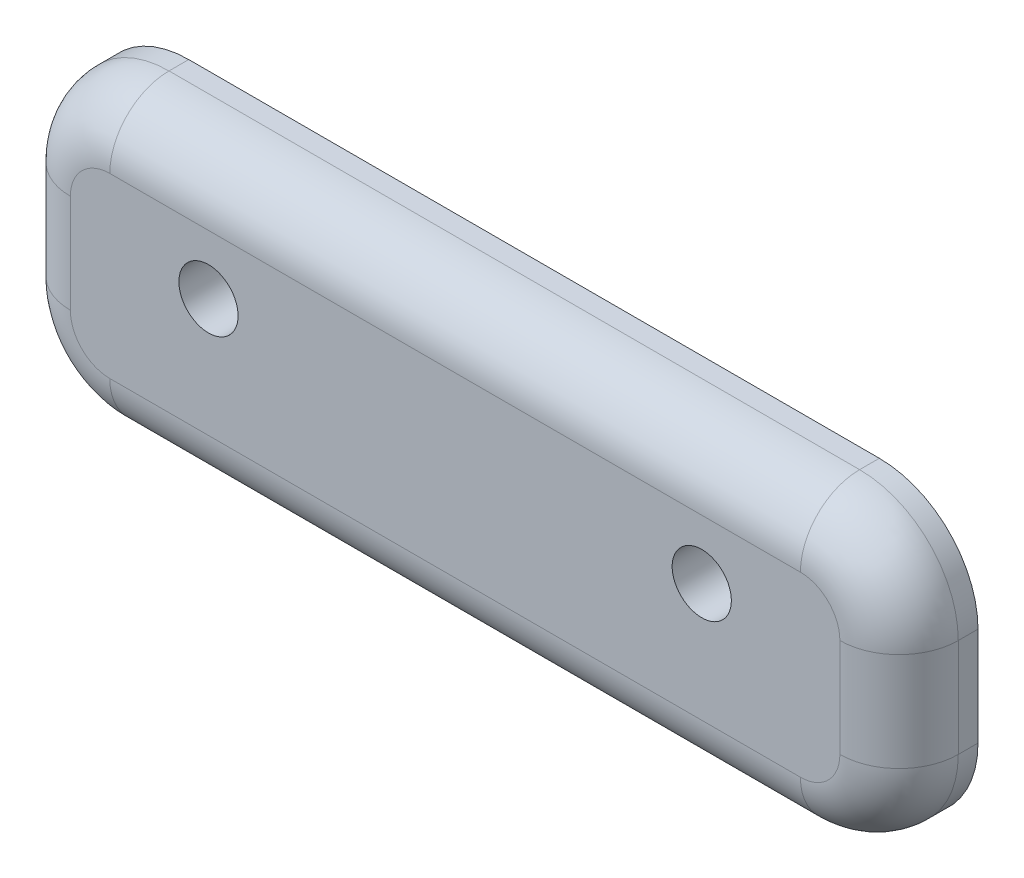
ISO-10303-21;
HEADER;
FILE_DESCRIPTION(('STEP AP214'),'2;1');
FILE_NAME('part.step','',(''),(''),'','','');
FILE_SCHEMA(('AUTOMOTIVE_DESIGN { 1 0 10303 214 1 1 1 1 }'));
ENDSEC;
DATA;
#1=APPLICATION_CONTEXT('core data for automotive mechanical design processes');
#2=APPLICATION_PROTOCOL_DEFINITION('international standard','automotive_design',2000,#1);
#3=PRODUCT_CONTEXT('',#1,'mechanical');
#4=PRODUCT('Part','Part','',(#3));
#5=PRODUCT_RELATED_PRODUCT_CATEGORY('part','',(#4));
#6=PRODUCT_DEFINITION_FORMATION('','',#4);
#7=PRODUCT_DEFINITION_CONTEXT('part definition',#1,'design');
#8=PRODUCT_DEFINITION('design','',#6,#7);
#9=PRODUCT_DEFINITION_SHAPE('','',#8);
#10=(LENGTH_UNIT() NAMED_UNIT(*) SI_UNIT(.MILLI.,.METRE.));
#11=(NAMED_UNIT(*) PLANE_ANGLE_UNIT() SI_UNIT($,.RADIAN.));
#12=(NAMED_UNIT(*) SI_UNIT($,.STERADIAN.) SOLID_ANGLE_UNIT());
#13=UNCERTAINTY_MEASURE_WITH_UNIT(LENGTH_MEASURE(1.E-05),#10,'distance_accuracy_value','');
#14=(GEOMETRIC_REPRESENTATION_CONTEXT(3) GLOBAL_UNCERTAINTY_ASSIGNED_CONTEXT((#13)) GLOBAL_UNIT_ASSIGNED_CONTEXT((#10,
#11,#12)) REPRESENTATION_CONTEXT('',''));
#15=CARTESIAN_POINT('',(0.,0.,0.));
#16=DIRECTION('',(0.,0.,1.));
#17=DIRECTION('',(1.,0.,0.));
#18=AXIS2_PLACEMENT_3D('',#15,#16,#17);
#19=CARTESIAN_POINT('',(-22.5,-7.5,4.));
#20=DIRECTION('',(1.,0.,0.));
#21=DIRECTION('',(0.,0.,-1.));
#22=AXIS2_PLACEMENT_3D('',#19,#20,#21);
#23=PLANE('',#22);
#24=DIRECTION('',(0.,0.,-1.));
#25=VECTOR('',#24,1.);
#26=CARTESIAN_POINT('',(-22.5,-2.5,4.));
#27=LINE('',#26,#25);
#28=CARTESIAN_POINT('',(-22.5,-2.5,0.));
#29=VERTEX_POINT('',#28);
#30=CARTESIAN_POINT('',(-22.5,-2.5,1.));
#31=VERTEX_POINT('',#30);
#32=EDGE_CURVE('E164',#29,#31,#27,.F.);
#33=ORIENTED_EDGE('',*,*,#32,.T.);
#34=DIRECTION('',(0.,-1.,0.));
#35=VECTOR('',#34,1.);
#36=CARTESIAN_POINT('',(-22.5,2.5,1.));
#37=LINE('',#36,#35);
#38=CARTESIAN_POINT('',(-22.5,2.5,1.));
#39=VERTEX_POINT('',#38);
#40=EDGE_CURVE('E192',#31,#39,#37,.F.);
#41=ORIENTED_EDGE('',*,*,#40,.T.);
#42=DIRECTION('',(0.,0.,-1.));
#43=VECTOR('',#42,1.);
#44=CARTESIAN_POINT('',(-22.5,2.5,4.));
#45=LINE('',#44,#43);
#46=CARTESIAN_POINT('',(-22.5,2.5,0.));
#47=VERTEX_POINT('',#46);
#48=EDGE_CURVE('E162',#39,#47,#45,.T.);
#49=ORIENTED_EDGE('',*,*,#48,.T.);
#50=DIRECTION('',(0.,-1.,0.));
#51=VECTOR('',#50,1.);
#52=CARTESIAN_POINT('',(-22.5,-7.5,0.));
#53=LINE('',#52,#51);
#54=EDGE_CURVE('E151',#47,#29,#53,.T.);
#55=ORIENTED_EDGE('',*,*,#54,.T.);
#56=EDGE_LOOP('',(#33,#41,#49,#55));
#57=FACE_BOUND('',#56,.T.);
#58=ADVANCED_FACE('F35',(#57),#23,.F.);
#59=CARTESIAN_POINT('',(22.5,-7.5,4.));
#60=DIRECTION('',(0.,1.,0.));
#61=DIRECTION('',(-1.,0.,0.));
#62=AXIS2_PLACEMENT_3D('',#59,#60,#61);
#63=PLANE('',#62);
#64=DIRECTION('',(0.,0.,-1.));
#65=VECTOR('',#64,1.);
#66=CARTESIAN_POINT('',(17.5,-7.5,4.));
#67=LINE('',#66,#65);
#68=CARTESIAN_POINT('',(17.5,-7.5,0.));
#69=VERTEX_POINT('',#68);
#70=CARTESIAN_POINT('',(17.5,-7.5,1.));
#71=VERTEX_POINT('',#70);
#72=EDGE_CURVE('E136',#69,#71,#67,.F.);
#73=ORIENTED_EDGE('',*,*,#72,.T.);
#74=DIRECTION('',(1.,0.,0.));
#75=VECTOR('',#74,1.);
#76=CARTESIAN_POINT('',(-17.5,-7.5,1.));
#77=LINE('',#76,#75);
#78=CARTESIAN_POINT('',(-17.5,-7.5,1.));
#79=VERTEX_POINT('',#78);
#80=EDGE_CURVE('E11',#71,#79,#77,.F.);
#81=ORIENTED_EDGE('',*,*,#80,.T.);
#82=DIRECTION('',(0.,0.,-1.));
#83=VECTOR('',#82,1.);
#84=CARTESIAN_POINT('',(-17.5,-7.5,4.));
#85=LINE('',#84,#83);
#86=CARTESIAN_POINT('',(-17.5,-7.5,0.));
#87=VERTEX_POINT('',#86);
#88=EDGE_CURVE('E140',#79,#87,#85,.T.);
#89=ORIENTED_EDGE('',*,*,#88,.T.);
#90=DIRECTION('',(1.,0.,0.));
#91=VECTOR('',#90,1.);
#92=CARTESIAN_POINT('',(22.5,-7.5,0.));
#93=LINE('',#92,#91);
#94=EDGE_CURVE('E147',#87,#69,#93,.T.);
#95=ORIENTED_EDGE('',*,*,#94,.T.);
#96=EDGE_LOOP('',(#73,#81,#89,#95));
#97=FACE_BOUND('',#96,.T.);
#98=ADVANCED_FACE('F302',(#97),#63,.F.);
#99=CARTESIAN_POINT('',(22.5,-7.5,4.));
#100=DIRECTION('',(-1.,0.,0.));
#101=DIRECTION('',(0.,0.,1.));
#102=AXIS2_PLACEMENT_3D('',#99,#100,#101);
#103=PLANE('',#102);
#104=DIRECTION('',(0.,0.,-1.));
#105=VECTOR('',#104,1.);
#106=CARTESIAN_POINT('',(22.5,2.5,4.));
#107=LINE('',#106,#105);
#108=CARTESIAN_POINT('',(22.5,2.5,0.));
#109=VERTEX_POINT('',#108);
#110=CARTESIAN_POINT('',(22.5,2.5,1.));
#111=VERTEX_POINT('',#110);
#112=EDGE_CURVE('E132',#109,#111,#107,.F.);
#113=ORIENTED_EDGE('',*,*,#112,.T.);
#114=DIRECTION('',(0.,1.,0.));
#115=VECTOR('',#114,1.);
#116=CARTESIAN_POINT('',(22.5,-2.5,1.));
#117=LINE('',#116,#115);
#118=CARTESIAN_POINT('',(22.5,-2.5,1.));
#119=VERTEX_POINT('',#118);
#120=EDGE_CURVE('E59',#111,#119,#117,.F.);
#121=ORIENTED_EDGE('',*,*,#120,.T.);
#122=DIRECTION('',(0.,0.,-1.));
#123=VECTOR('',#122,1.);
#124=CARTESIAN_POINT('',(22.5,-2.5,4.));
#125=LINE('',#124,#123);
#126=CARTESIAN_POINT('',(22.5,-2.5,0.));
#127=VERTEX_POINT('',#126);
#128=EDGE_CURVE('E124',#119,#127,#125,.T.);
#129=ORIENTED_EDGE('',*,*,#128,.T.);
#130=DIRECTION('',(0.,1.,0.));
#131=VECTOR('',#130,1.);
#132=CARTESIAN_POINT('',(22.5,-7.5,0.));
#133=LINE('',#132,#131);
#134=EDGE_CURVE('E128',#127,#109,#133,.T.);
#135=ORIENTED_EDGE('',*,*,#134,.T.);
#136=EDGE_LOOP('',(#113,#121,#129,#135));
#137=FACE_BOUND('',#136,.T.);
#138=ADVANCED_FACE('F126',(#137),#103,.F.);
#139=CARTESIAN_POINT('',(22.5,7.5,4.));
#140=DIRECTION('',(0.,-1.,0.));
#141=DIRECTION('',(1.,0.,0.));
#142=AXIS2_PLACEMENT_3D('',#139,#140,#141);
#143=PLANE('',#142);
#144=DIRECTION('',(0.,0.,-1.));
#145=VECTOR('',#144,1.);
#146=CARTESIAN_POINT('',(-17.5,7.5,4.));
#147=LINE('',#146,#145);
#148=CARTESIAN_POINT('',(-17.5,7.5,0.));
#149=VERTEX_POINT('',#148);
#150=CARTESIAN_POINT('',(-17.5,7.5,1.));
#151=VERTEX_POINT('',#150);
#152=EDGE_CURVE('E169',#149,#151,#147,.F.);
#153=ORIENTED_EDGE('',*,*,#152,.T.);
#154=DIRECTION('',(-1.,0.,0.));
#155=VECTOR('',#154,1.);
#156=CARTESIAN_POINT('',(17.5,7.5,1.));
#157=LINE('',#156,#155);
#158=CARTESIAN_POINT('',(17.5,7.5,1.));
#159=VERTEX_POINT('',#158);
#160=EDGE_CURVE('E196',#151,#159,#157,.F.);
#161=ORIENTED_EDGE('',*,*,#160,.T.);
#162=DIRECTION('',(0.,0.,-1.));
#163=VECTOR('',#162,1.);
#164=CARTESIAN_POINT('',(17.5,7.5,4.));
#165=LINE('',#164,#163);
#166=CARTESIAN_POINT('',(17.5,7.5,0.));
#167=VERTEX_POINT('',#166);
#168=EDGE_CURVE('E167',#159,#167,#165,.T.);
#169=ORIENTED_EDGE('',*,*,#168,.T.);
#170=DIRECTION('',(-1.,0.,0.));
#171=VECTOR('',#170,1.);
#172=CARTESIAN_POINT('',(22.5,7.5,0.));
#173=LINE('',#172,#171);
#174=EDGE_CURVE('E146',#167,#149,#173,.T.);
#175=ORIENTED_EDGE('',*,*,#174,.T.);
#176=EDGE_LOOP('',(#153,#161,#169,#175));
#177=FACE_BOUND('',#176,.T.);
#178=ADVANCED_FACE('F257',(#177),#143,.F.);
#179=CARTESIAN_POINT('',(0.,0.,4.));
#180=DIRECTION('',(0.,0.,1.));
#181=DIRECTION('',(1.,0.,0.));
#182=AXIS2_PLACEMENT_3D('',#179,#180,#181);
#183=PLANE('',#182);
#184=CARTESIAN_POINT('',(12.5,1.5,4.));
#185=DIRECTION('',(0.,0.,1.));
#186=DIRECTION('',(1.,0.,0.));
#187=AXIS2_PLACEMENT_3D('',#184,#185,#186);
#188=CIRCLE('',#187,1.5);
#189=CARTESIAN_POINT('',(14.,1.5,4.));
#190=VERTEX_POINT('',#189);
#191=EDGE_CURVE('E239',#190,#190,#188,.T.);
#192=ORIENTED_EDGE('',*,*,#191,.F.);
#193=EDGE_LOOP('',(#192));
#194=FACE_BOUND('',#193,.T.);
#195=CARTESIAN_POINT('',(-12.5,1.5,4.));
#196=DIRECTION('',(0.,0.,1.));
#197=DIRECTION('',(1.,0.,0.));
#198=AXIS2_PLACEMENT_3D('',#195,#196,#197);
#199=CIRCLE('',#198,1.5);
#200=CARTESIAN_POINT('',(-11.,1.5,4.));
#201=VERTEX_POINT('',#200);
#202=EDGE_CURVE('E233',#201,#201,#199,.T.);
#203=ORIENTED_EDGE('',*,*,#202,.F.);
#204=EDGE_LOOP('',(#203));
#205=FACE_BOUND('',#204,.T.);
#206=DIRECTION('',(0.,-1.,0.));
#207=VECTOR('',#206,1.);
#208=CARTESIAN_POINT('',(-19.5,-2.5,4.));
#209=LINE('',#208,#207);
#210=CARTESIAN_POINT('',(-19.5,2.5,4.));
#211=VERTEX_POINT('',#210);
#212=CARTESIAN_POINT('',(-19.5,-2.5,4.));
#213=VERTEX_POINT('',#212);
#214=EDGE_CURVE('E184',#211,#213,#209,.T.);
#215=ORIENTED_EDGE('',*,*,#214,.T.);
#216=CARTESIAN_POINT('',(-17.5,-2.5,4.));
#217=DIRECTION('',(0.,0.,1.));
#218=DIRECTION('',(1.,0.,0.));
#219=AXIS2_PLACEMENT_3D('',#216,#217,#218);
#220=CIRCLE('',#219,2.);
#221=CARTESIAN_POINT('',(-17.5,-4.5,4.));
#222=VERTEX_POINT('',#221);
#223=EDGE_CURVE('E186',#213,#222,#220,.T.);
#224=ORIENTED_EDGE('',*,*,#223,.T.);
#225=DIRECTION('',(1.,0.,0.));
#226=VECTOR('',#225,1.);
#227=CARTESIAN_POINT('',(17.5,-4.5,4.));
#228=LINE('',#227,#226);
#229=CARTESIAN_POINT('',(17.5,-4.5,4.));
#230=VERTEX_POINT('',#229);
#231=EDGE_CURVE('E172',#222,#230,#228,.T.);
#232=ORIENTED_EDGE('',*,*,#231,.T.);
#233=CARTESIAN_POINT('',(17.5,-2.5,4.));
#234=DIRECTION('',(0.,0.,1.));
#235=DIRECTION('',(1.,0.,0.));
#236=AXIS2_PLACEMENT_3D('',#233,#234,#235);
#237=CIRCLE('',#236,2.);
#238=CARTESIAN_POINT('',(19.5,-2.5,4.));
#239=VERTEX_POINT('',#238);
#240=EDGE_CURVE('E174',#230,#239,#237,.T.);
#241=ORIENTED_EDGE('',*,*,#240,.T.);
#242=DIRECTION('',(0.,1.,0.));
#243=VECTOR('',#242,1.);
#244=CARTESIAN_POINT('',(19.5,2.5,4.));
#245=LINE('',#244,#243);
#246=CARTESIAN_POINT('',(19.5,2.5,4.));
#247=VERTEX_POINT('',#246);
#248=EDGE_CURVE('E176',#239,#247,#245,.T.);
#249=ORIENTED_EDGE('',*,*,#248,.T.);
#250=CARTESIAN_POINT('',(17.5,2.5,4.));
#251=DIRECTION('',(0.,0.,1.));
#252=DIRECTION('',(1.,0.,0.));
#253=AXIS2_PLACEMENT_3D('',#250,#251,#252);
#254=CIRCLE('',#253,2.);
#255=CARTESIAN_POINT('',(17.5,4.5,4.));
#256=VERTEX_POINT('',#255);
#257=EDGE_CURVE('E178',#247,#256,#254,.T.);
#258=ORIENTED_EDGE('',*,*,#257,.T.);
#259=DIRECTION('',(-1.,0.,0.));
#260=VECTOR('',#259,1.);
#261=CARTESIAN_POINT('',(-17.5,4.5,4.));
#262=LINE('',#261,#260);
#263=CARTESIAN_POINT('',(-17.5,4.5,4.));
#264=VERTEX_POINT('',#263);
#265=EDGE_CURVE('E180',#256,#264,#262,.T.);
#266=ORIENTED_EDGE('',*,*,#265,.T.);
#267=CARTESIAN_POINT('',(-17.5,2.5,4.));
#268=DIRECTION('',(0.,0.,1.));
#269=DIRECTION('',(1.,0.,0.));
#270=AXIS2_PLACEMENT_3D('',#267,#268,#269);
#271=CIRCLE('',#270,2.);
#272=EDGE_CURVE('E182',#264,#211,#271,.T.);
#273=ORIENTED_EDGE('',*,*,#272,.T.);
#274=EDGE_LOOP('',(#215,#224,#232,#241,#249,#258,#266,#273));
#275=FACE_BOUND('',#274,.T.);
#276=ADVANCED_FACE('F254',(#194,#205,#275),#183,.T.);
#277=CARTESIAN_POINT('',(0.,0.,0.));
#278=DIRECTION('',(0.,0.,1.));
#279=DIRECTION('',(1.,0.,0.));
#280=AXIS2_PLACEMENT_3D('',#277,#278,#279);
#281=PLANE('',#280);
#282=CARTESIAN_POINT('',(12.5,1.5,0.));
#283=DIRECTION('',(0.,0.,1.));
#284=DIRECTION('',(1.,0.,0.));
#285=AXIS2_PLACEMENT_3D('',#282,#283,#284);
#286=CIRCLE('',#285,1.5);
#287=CARTESIAN_POINT('',(14.,1.5,0.));
#288=VERTEX_POINT('',#287);
#289=EDGE_CURVE('E236',#288,#288,#286,.T.);
#290=ORIENTED_EDGE('',*,*,#289,.T.);
#291=EDGE_LOOP('',(#290));
#292=FACE_BOUND('',#291,.T.);
#293=CARTESIAN_POINT('',(-12.5,1.5,0.));
#294=DIRECTION('',(0.,0.,1.));
#295=DIRECTION('',(1.,0.,0.));
#296=AXIS2_PLACEMENT_3D('',#293,#294,#295);
#297=CIRCLE('',#296,1.5);
#298=CARTESIAN_POINT('',(-11.,1.5,0.));
#299=VERTEX_POINT('',#298);
#300=EDGE_CURVE('E205',#299,#299,#297,.T.);
#301=ORIENTED_EDGE('',*,*,#300,.T.);
#302=EDGE_LOOP('',(#301));
#303=FACE_BOUND('',#302,.T.);
#304=ORIENTED_EDGE('',*,*,#134,.F.);
#305=CARTESIAN_POINT('',(17.5,-2.5,0.));
#306=DIRECTION('',(0.,0.,1.));
#307=DIRECTION('',(1.,0.,0.));
#308=AXIS2_PLACEMENT_3D('',#305,#306,#307);
#309=CIRCLE('',#308,5.);
#310=EDGE_CURVE('E134',#127,#69,#309,.F.);
#311=ORIENTED_EDGE('',*,*,#310,.T.);
#312=ORIENTED_EDGE('',*,*,#94,.F.);
#313=CARTESIAN_POINT('',(-17.5,-2.5,0.));
#314=DIRECTION('',(0.,0.,1.));
#315=DIRECTION('',(1.,0.,0.));
#316=AXIS2_PLACEMENT_3D('',#313,#314,#315);
#317=CIRCLE('',#316,5.);
#318=EDGE_CURVE('E141',#87,#29,#317,.F.);
#319=ORIENTED_EDGE('',*,*,#318,.T.);
#320=ORIENTED_EDGE('',*,*,#54,.F.);
#321=CARTESIAN_POINT('',(-17.5,2.5,0.));
#322=DIRECTION('',(0.,0.,1.));
#323=DIRECTION('',(1.,0.,0.));
#324=AXIS2_PLACEMENT_3D('',#321,#322,#323);
#325=CIRCLE('',#324,5.);
#326=EDGE_CURVE('E157',#47,#149,#325,.F.);
#327=ORIENTED_EDGE('',*,*,#326,.T.);
#328=ORIENTED_EDGE('',*,*,#174,.F.);
#329=CARTESIAN_POINT('',(17.5,2.5,0.));
#330=DIRECTION('',(0.,0.,1.));
#331=DIRECTION('',(1.,0.,0.));
#332=AXIS2_PLACEMENT_3D('',#329,#330,#331);
#333=CIRCLE('',#332,5.);
#334=EDGE_CURVE('E131',#167,#109,#333,.F.);
#335=ORIENTED_EDGE('',*,*,#334,.T.);
#336=EDGE_LOOP('',(#304,#311,#312,#319,#320,#327,#328,#335));
#337=FACE_BOUND('',#336,.T.);
#338=ADVANCED_FACE('F143',(#292,#303,#337),#281,.F.);
#339=CARTESIAN_POINT('',(17.5,-2.5,4.));
#340=DIRECTION('',(0.,0.,-1.));
#341=DIRECTION('',(-1.,0.,0.));
#342=AXIS2_PLACEMENT_3D('',#339,#340,#341);
#343=CYLINDRICAL_SURFACE('',#342,5.);
#344=ORIENTED_EDGE('',*,*,#128,.F.);
#345=CARTESIAN_POINT('',(17.5,-2.5,1.));
#346=DIRECTION('',(0.,0.,1.));
#347=DIRECTION('',(1.,0.,0.));
#348=AXIS2_PLACEMENT_3D('',#345,#346,#347);
#349=CIRCLE('',#348,5.);
#350=EDGE_CURVE('E44',#119,#71,#349,.F.);
#351=ORIENTED_EDGE('',*,*,#350,.T.);
#352=ORIENTED_EDGE('',*,*,#72,.F.);
#353=ORIENTED_EDGE('',*,*,#310,.F.);
#354=EDGE_LOOP('',(#344,#351,#352,#353));
#355=FACE_BOUND('',#354,.T.);
#356=ADVANCED_FACE('F135',(#355),#343,.T.);
#357=CARTESIAN_POINT('',(-17.5,-2.5,4.));
#358=DIRECTION('',(0.,0.,-1.));
#359=DIRECTION('',(-1.,0.,0.));
#360=AXIS2_PLACEMENT_3D('',#357,#358,#359);
#361=CYLINDRICAL_SURFACE('',#360,5.);
#362=ORIENTED_EDGE('',*,*,#88,.F.);
#363=CARTESIAN_POINT('',(-17.5,-2.5,1.));
#364=DIRECTION('',(0.,0.,1.));
#365=DIRECTION('',(1.,0.,0.));
#366=AXIS2_PLACEMENT_3D('',#363,#364,#365);
#367=CIRCLE('',#366,5.);
#368=EDGE_CURVE('E189',#79,#31,#367,.F.);
#369=ORIENTED_EDGE('',*,*,#368,.T.);
#370=ORIENTED_EDGE('',*,*,#32,.F.);
#371=ORIENTED_EDGE('',*,*,#318,.F.);
#372=EDGE_LOOP('',(#362,#369,#370,#371));
#373=FACE_BOUND('',#372,.T.);
#374=ADVANCED_FACE('F300',(#373),#361,.T.);
#375=CARTESIAN_POINT('',(-17.5,2.5,4.));
#376=DIRECTION('',(0.,0.,-1.));
#377=DIRECTION('',(-1.,0.,0.));
#378=AXIS2_PLACEMENT_3D('',#375,#376,#377);
#379=CYLINDRICAL_SURFACE('',#378,5.);
#380=ORIENTED_EDGE('',*,*,#48,.F.);
#381=CARTESIAN_POINT('',(-17.5,2.5,1.));
#382=DIRECTION('',(0.,0.,1.));
#383=DIRECTION('',(1.,0.,0.));
#384=AXIS2_PLACEMENT_3D('',#381,#382,#383);
#385=CIRCLE('',#384,5.);
#386=EDGE_CURVE('E194',#39,#151,#385,.F.);
#387=ORIENTED_EDGE('',*,*,#386,.T.);
#388=ORIENTED_EDGE('',*,*,#152,.F.);
#389=ORIENTED_EDGE('',*,*,#326,.F.);
#390=EDGE_LOOP('',(#380,#387,#388,#389));
#391=FACE_BOUND('',#390,.T.);
#392=ADVANCED_FACE('F293',(#391),#379,.T.);
#393=CARTESIAN_POINT('',(17.5,2.5,4.));
#394=DIRECTION('',(0.,0.,-1.));
#395=DIRECTION('',(-1.,0.,0.));
#396=AXIS2_PLACEMENT_3D('',#393,#394,#395);
#397=CYLINDRICAL_SURFACE('',#396,5.);
#398=ORIENTED_EDGE('',*,*,#168,.F.);
#399=CARTESIAN_POINT('',(17.5,2.5,1.));
#400=DIRECTION('',(0.,0.,1.));
#401=DIRECTION('',(1.,0.,0.));
#402=AXIS2_PLACEMENT_3D('',#399,#400,#401);
#403=CIRCLE('',#402,5.);
#404=EDGE_CURVE('E198',#159,#111,#403,.F.);
#405=ORIENTED_EDGE('',*,*,#404,.T.);
#406=ORIENTED_EDGE('',*,*,#112,.F.);
#407=ORIENTED_EDGE('',*,*,#334,.F.);
#408=EDGE_LOOP('',(#398,#405,#406,#407));
#409=FACE_BOUND('',#408,.T.);
#410=ADVANCED_FACE('F317',(#409),#397,.T.);
#411=CARTESIAN_POINT('',(17.5,2.5,1.));
#412=DIRECTION('',(0.,0.,1.));
#413=DIRECTION('',(1.,0.,0.));
#414=AXIS2_PLACEMENT_3D('',#411,#412,#413);
#415=DEGENERATE_TOROIDAL_SURFACE('',#414,2.,3.,.T.);
#416=CARTESIAN_POINT('',(19.5,2.5,1.));
#417=DIRECTION('',(0.,-1.,0.));
#418=DIRECTION('',(1.,0.,0.));
#419=AXIS2_PLACEMENT_3D('',#416,#417,#418);
#420=CIRCLE('',#419,3.);
#421=EDGE_CURVE('E218',#111,#247,#420,.T.);
#422=ORIENTED_EDGE('',*,*,#421,.F.);
#423=ORIENTED_EDGE('',*,*,#404,.F.);
#424=CARTESIAN_POINT('',(17.5,4.5,1.));
#425=DIRECTION('',(-1.,0.,0.));
#426=DIRECTION('',(0.,0.,1.));
#427=AXIS2_PLACEMENT_3D('',#424,#425,#426);
#428=CIRCLE('',#427,3.);
#429=EDGE_CURVE('E39',#256,#159,#428,.T.);
#430=ORIENTED_EDGE('',*,*,#429,.F.);
#431=ORIENTED_EDGE('',*,*,#257,.F.);
#432=EDGE_LOOP('',(#422,#423,#430,#431));
#433=FACE_BOUND('',#432,.T.);
#434=ADVANCED_FACE('F37',(#433),#415,.T.);
#435=CARTESIAN_POINT('',(0.,4.5,1.));
#436=DIRECTION('',(1.,0.,0.));
#437=DIRECTION('',(0.,1.,0.));
#438=AXIS2_PLACEMENT_3D('',#435,#436,#437);
#439=CYLINDRICAL_SURFACE('',#438,3.);
#440=ORIENTED_EDGE('',*,*,#429,.T.);
#441=ORIENTED_EDGE('',*,*,#160,.F.);
#442=CARTESIAN_POINT('',(-17.5,4.5,1.));
#443=DIRECTION('',(-1.,0.,0.));
#444=DIRECTION('',(0.,-1.,0.));
#445=AXIS2_PLACEMENT_3D('',#442,#443,#444);
#446=CIRCLE('',#445,3.);
#447=EDGE_CURVE('E216',#264,#151,#446,.T.);
#448=ORIENTED_EDGE('',*,*,#447,.F.);
#449=ORIENTED_EDGE('',*,*,#265,.F.);
#450=EDGE_LOOP('',(#440,#441,#448,#449));
#451=FACE_BOUND('',#450,.T.);
#452=ADVANCED_FACE('F286',(#451),#439,.T.);
#453=CARTESIAN_POINT('',(19.5,0.,1.));
#454=DIRECTION('',(0.,-1.,0.));
#455=DIRECTION('',(0.,0.,-1.));
#456=AXIS2_PLACEMENT_3D('',#453,#454,#455);
#457=CYLINDRICAL_SURFACE('',#456,3.);
#458=ORIENTED_EDGE('',*,*,#421,.T.);
#459=ORIENTED_EDGE('',*,*,#248,.F.);
#460=CARTESIAN_POINT('',(19.5,-2.5,1.));
#461=DIRECTION('',(0.,-1.,0.));
#462=DIRECTION('',(0.,0.,-1.));
#463=AXIS2_PLACEMENT_3D('',#460,#461,#462);
#464=CIRCLE('',#463,3.);
#465=EDGE_CURVE('E213',#119,#239,#464,.T.);
#466=ORIENTED_EDGE('',*,*,#465,.F.);
#467=ORIENTED_EDGE('',*,*,#120,.F.);
#468=EDGE_LOOP('',(#458,#459,#466,#467));
#469=FACE_BOUND('',#468,.T.);
#470=ADVANCED_FACE('F281',(#469),#457,.T.);
#471=CARTESIAN_POINT('',(-17.5,2.5,1.));
#472=DIRECTION('',(0.,0.,1.));
#473=DIRECTION('',(1.,0.,0.));
#474=AXIS2_PLACEMENT_3D('',#471,#472,#473);
#475=DEGENERATE_TOROIDAL_SURFACE('',#474,2.,3.,.T.);
#476=ORIENTED_EDGE('',*,*,#447,.T.);
#477=ORIENTED_EDGE('',*,*,#386,.F.);
#478=CARTESIAN_POINT('',(-19.5,2.5,1.));
#479=DIRECTION('',(0.,-1.,0.));
#480=DIRECTION('',(0.,0.,-1.));
#481=AXIS2_PLACEMENT_3D('',#478,#479,#480);
#482=CIRCLE('',#481,3.);
#483=EDGE_CURVE('E210',#211,#39,#482,.T.);
#484=ORIENTED_EDGE('',*,*,#483,.F.);
#485=ORIENTED_EDGE('',*,*,#272,.F.);
#486=EDGE_LOOP('',(#476,#477,#484,#485));
#487=FACE_BOUND('',#486,.T.);
#488=ADVANCED_FACE('F289',(#487),#475,.T.);
#489=CARTESIAN_POINT('',(17.5,-2.5,1.));
#490=DIRECTION('',(0.,0.,1.));
#491=DIRECTION('',(1.,0.,0.));
#492=AXIS2_PLACEMENT_3D('',#489,#490,#491);
#493=DEGENERATE_TOROIDAL_SURFACE('',#492,2.,3.,.T.);
#494=ORIENTED_EDGE('',*,*,#465,.T.);
#495=ORIENTED_EDGE('',*,*,#240,.F.);
#496=CARTESIAN_POINT('',(17.5,-4.5,1.));
#497=DIRECTION('',(-1.,0.,0.));
#498=DIRECTION('',(0.,0.,1.));
#499=AXIS2_PLACEMENT_3D('',#496,#497,#498);
#500=CIRCLE('',#499,3.);
#501=EDGE_CURVE('E207',#71,#230,#500,.T.);
#502=ORIENTED_EDGE('',*,*,#501,.F.);
#503=ORIENTED_EDGE('',*,*,#350,.F.);
#504=EDGE_LOOP('',(#494,#495,#502,#503));
#505=FACE_BOUND('',#504,.T.);
#506=ADVANCED_FACE('F280',(#505),#493,.T.);
#507=CARTESIAN_POINT('',(-19.5,0.,1.));
#508=DIRECTION('',(0.,1.,0.));
#509=DIRECTION('',(0.,0.,1.));
#510=AXIS2_PLACEMENT_3D('',#507,#508,#509);
#511=CYLINDRICAL_SURFACE('',#510,3.);
#512=ORIENTED_EDGE('',*,*,#483,.T.);
#513=ORIENTED_EDGE('',*,*,#40,.F.);
#514=CARTESIAN_POINT('',(-19.5,-2.5,1.));
#515=DIRECTION('',(0.,-1.,0.));
#516=DIRECTION('',(1.,0.,0.));
#517=AXIS2_PLACEMENT_3D('',#514,#515,#516);
#518=CIRCLE('',#517,3.);
#519=EDGE_CURVE('E204',#213,#31,#518,.T.);
#520=ORIENTED_EDGE('',*,*,#519,.F.);
#521=ORIENTED_EDGE('',*,*,#214,.F.);
#522=EDGE_LOOP('',(#512,#513,#520,#521));
#523=FACE_BOUND('',#522,.T.);
#524=ADVANCED_FACE('F268',(#523),#511,.T.);
#525=CARTESIAN_POINT('',(0.,-4.5,1.));
#526=DIRECTION('',(-1.,0.,0.));
#527=DIRECTION('',(0.,-1.,0.));
#528=AXIS2_PLACEMENT_3D('',#525,#526,#527);
#529=CYLINDRICAL_SURFACE('',#528,3.);
#530=ORIENTED_EDGE('',*,*,#501,.T.);
#531=ORIENTED_EDGE('',*,*,#231,.F.);
#532=CARTESIAN_POINT('',(-17.5,-4.5,1.));
#533=DIRECTION('',(-1.,0.,0.));
#534=DIRECTION('',(0.,0.,1.));
#535=AXIS2_PLACEMENT_3D('',#532,#533,#534);
#536=CIRCLE('',#535,3.);
#537=EDGE_CURVE('E202',#79,#222,#536,.T.);
#538=ORIENTED_EDGE('',*,*,#537,.F.);
#539=ORIENTED_EDGE('',*,*,#80,.F.);
#540=EDGE_LOOP('',(#530,#531,#538,#539));
#541=FACE_BOUND('',#540,.T.);
#542=ADVANCED_FACE('F276',(#541),#529,.T.);
#543=CARTESIAN_POINT('',(-17.5,-2.5,1.));
#544=DIRECTION('',(0.,0.,1.));
#545=DIRECTION('',(1.,0.,0.));
#546=AXIS2_PLACEMENT_3D('',#543,#544,#545);
#547=DEGENERATE_TOROIDAL_SURFACE('',#546,2.,3.,.T.);
#548=ORIENTED_EDGE('',*,*,#519,.T.);
#549=ORIENTED_EDGE('',*,*,#368,.F.);
#550=ORIENTED_EDGE('',*,*,#537,.T.);
#551=ORIENTED_EDGE('',*,*,#223,.F.);
#552=EDGE_LOOP('',(#548,#549,#550,#551));
#553=FACE_BOUND('',#552,.T.);
#554=ADVANCED_FACE('F271',(#553),#547,.T.);
#555=CARTESIAN_POINT('',(-12.5,1.5,0.));
#556=DIRECTION('',(0.,0.,1.));
#557=DIRECTION('',(1.,0.,0.));
#558=AXIS2_PLACEMENT_3D('',#555,#556,#557);
#559=CYLINDRICAL_SURFACE('',#558,1.5);
#560=ORIENTED_EDGE('',*,*,#300,.F.);
#561=EDGE_LOOP('',(#560));
#562=FACE_BOUND('',#561,.T.);
#563=ORIENTED_EDGE('',*,*,#202,.T.);
#564=EDGE_LOOP('',(#563));
#565=FACE_BOUND('',#564,.T.);
#566=ADVANCED_FACE('F250',(#562,#565),#559,.F.);
#567=CARTESIAN_POINT('',(12.5,1.5,0.));
#568=DIRECTION('',(0.,0.,1.));
#569=DIRECTION('',(1.,0.,0.));
#570=AXIS2_PLACEMENT_3D('',#567,#568,#569);
#571=CYLINDRICAL_SURFACE('',#570,1.5);
#572=ORIENTED_EDGE('',*,*,#289,.F.);
#573=EDGE_LOOP('',(#572));
#574=FACE_BOUND('',#573,.T.);
#575=ORIENTED_EDGE('',*,*,#191,.T.);
#576=EDGE_LOOP('',(#575));
#577=FACE_BOUND('',#576,.T.);
#578=ADVANCED_FACE('F247',(#574,#577),#571,.F.);
#579=CLOSED_SHELL('',(#58,#98,#138,#178,#276,#338,#356,#374,#392,#410,#434,#452,#470,#488,#506,
#524,#542,#554,#566,#578));
#580=MANIFOLD_SOLID_BREP('B2',#579);
#581=ADVANCED_BREP_SHAPE_REPRESENTATION('',(#18,#580),#14);
#582=SHAPE_DEFINITION_REPRESENTATION(#9,#581);
ENDSEC;
END-ISO-10303-21;
